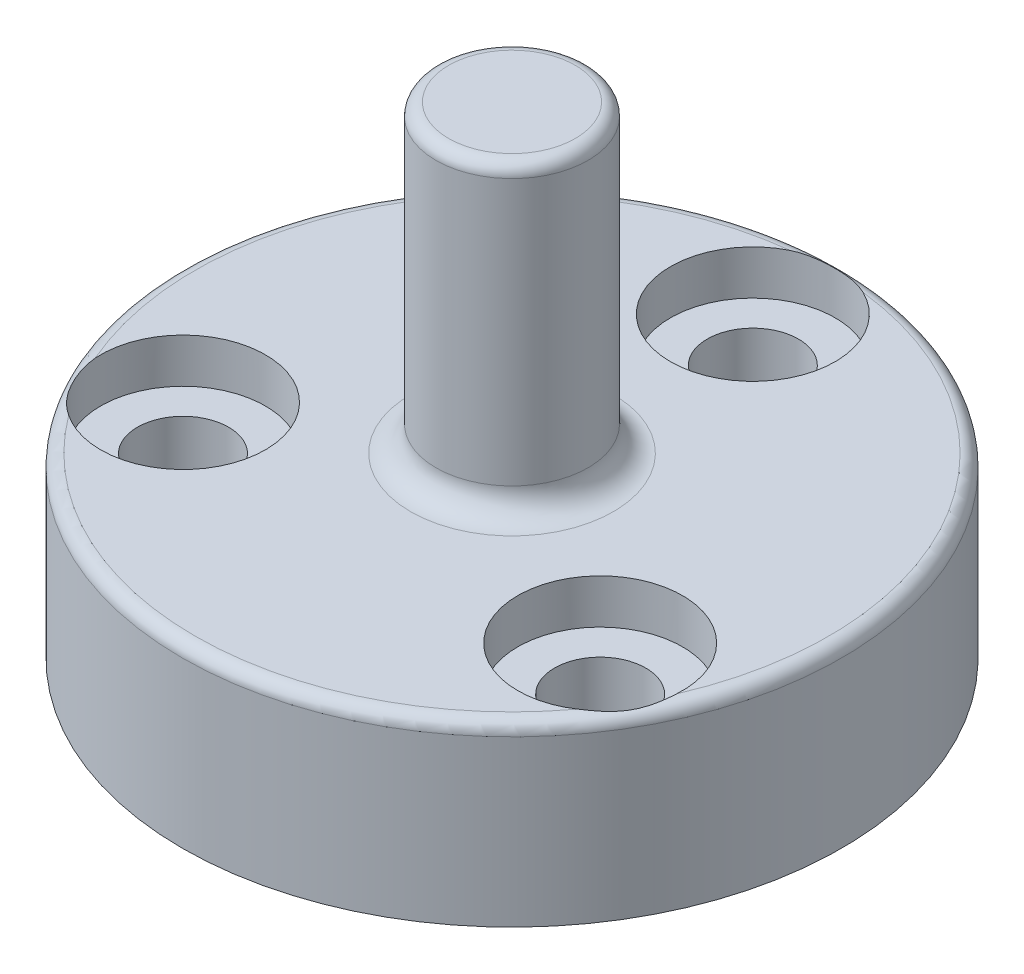
ISO-10303-21;
HEADER;
FILE_DESCRIPTION(('STEP AP214'),'2;1');
FILE_NAME('part.step','',(''),(''),'','','');
FILE_SCHEMA(('AUTOMOTIVE_DESIGN { 1 0 10303 214 1 1 1 1 }'));
ENDSEC;
DATA;
#1=APPLICATION_CONTEXT('core data for automotive mechanical design processes');
#2=APPLICATION_PROTOCOL_DEFINITION('international standard','automotive_design',2000,#1);
#3=PRODUCT_CONTEXT('',#1,'mechanical');
#4=PRODUCT('Part','Part','',(#3));
#5=PRODUCT_RELATED_PRODUCT_CATEGORY('part','',(#4));
#6=PRODUCT_DEFINITION_FORMATION('','',#4);
#7=PRODUCT_DEFINITION_CONTEXT('part definition',#1,'design');
#8=PRODUCT_DEFINITION('design','',#6,#7);
#9=PRODUCT_DEFINITION_SHAPE('','',#8);
#10=(LENGTH_UNIT() NAMED_UNIT(*) SI_UNIT(.MILLI.,.METRE.));
#11=(NAMED_UNIT(*) PLANE_ANGLE_UNIT() SI_UNIT($,.RADIAN.));
#12=(NAMED_UNIT(*) SI_UNIT($,.STERADIAN.) SOLID_ANGLE_UNIT());
#13=UNCERTAINTY_MEASURE_WITH_UNIT(LENGTH_MEASURE(1.E-05),#10,'distance_accuracy_value','');
#14=(GEOMETRIC_REPRESENTATION_CONTEXT(3) GLOBAL_UNCERTAINTY_ASSIGNED_CONTEXT((#13)) GLOBAL_UNIT_ASSIGNED_CONTEXT((#10,
#11,#12)) REPRESENTATION_CONTEXT('',''));
#15=CARTESIAN_POINT('',(0.,0.,0.));
#16=DIRECTION('',(0.,0.,1.));
#17=DIRECTION('',(1.,0.,0.));
#18=AXIS2_PLACEMENT_3D('',#15,#16,#17);
#19=CARTESIAN_POINT('',(0.,7.,0.));
#20=DIRECTION('',(0.,-1.,0.));
#21=DIRECTION('',(0.,0.,-1.));
#22=AXIS2_PLACEMENT_3D('',#19,#20,#21);
#23=CYLINDRICAL_SURFACE('',#22,13.);
#24=CARTESIAN_POINT('',(0.,6.5,0.));
#25=DIRECTION('',(0.,1.,0.));
#26=DIRECTION('',(0.,0.,1.));
#27=AXIS2_PLACEMENT_3D('',#24,#25,#26);
#28=CIRCLE('',#27,13.);
#29=CARTESIAN_POINT('',(0.,6.5,13.));
#30=VERTEX_POINT('',#29);
#31=EDGE_CURVE('E99',#30,#30,#28,.F.);
#32=ORIENTED_EDGE('',*,*,#31,.T.);
#33=EDGE_LOOP('',(#32));
#34=FACE_BOUND('',#33,.T.);
#35=CARTESIAN_POINT('',(0.,0.,0.));
#36=DIRECTION('',(0.,1.,0.));
#37=DIRECTION('',(0.,0.,1.));
#38=AXIS2_PLACEMENT_3D('',#35,#36,#37);
#39=CIRCLE('',#38,13.);
#40=CARTESIAN_POINT('',(0.,0.,13.));
#41=VERTEX_POINT('',#40);
#42=EDGE_CURVE('E95',#41,#41,#39,.T.);
#43=ORIENTED_EDGE('',*,*,#42,.T.);
#44=EDGE_LOOP('',(#43));
#45=FACE_BOUND('',#44,.T.);
#46=ADVANCED_FACE('F35',(#34,#45),#23,.T.);
#47=CARTESIAN_POINT('',(0.,7.,0.));
#48=DIRECTION('',(0.,1.,0.));
#49=DIRECTION('',(0.,0.,1.));
#50=AXIS2_PLACEMENT_3D('',#47,#48,#49);
#51=PLANE('',#50);
#52=CARTESIAN_POINT('',(0.,7.,-9.5));
#53=DIRECTION('',(0.,1.,0.));
#54=DIRECTION('',(0.,0.,1.));
#55=AXIS2_PLACEMENT_3D('',#52,#53,#54);
#56=CIRCLE('',#55,3.25);
#57=CARTESIAN_POINT('',(-1.43148809091607,7.,-12.4177631578943));
#58=VERTEX_POINT('',#57);
#59=CARTESIAN_POINT('',(1.43148809091524,7.,-12.4177631578947));
#60=VERTEX_POINT('',#59);
#61=EDGE_CURVE('E49',#58,#60,#56,.T.);
#62=ORIENTED_EDGE('',*,*,#61,.F.);
#63=CARTESIAN_POINT('',(0.,7.,0.));
#64=DIRECTION('',(0.,1.,0.));
#65=DIRECTION('',(0.,0.,1.));
#66=AXIS2_PLACEMENT_3D('',#63,#64,#65);
#67=CIRCLE('',#66,12.5);
#68=CARTESIAN_POINT('',(-11.4698423983729,7.,4.96917652699988));
#69=VERTEX_POINT('',#68);
#70=EDGE_CURVE('E81',#58,#69,#67,.T.);
#71=ORIENTED_EDGE('',*,*,#70,.T.);
#72=CARTESIAN_POINT('',(-8.22724133595217,7.,4.75));
#73=DIRECTION('',(0.,1.,0.));
#74=DIRECTION('',(0.,0.,1.));
#75=AXIS2_PLACEMENT_3D('',#72,#73,#74);
#76=CIRCLE('',#75,3.25);
#77=CARTESIAN_POINT('',(-10.0383543074569,7.,7.44858663089536));
#78=VERTEX_POINT('',#77);
#79=EDGE_CURVE('E179',#78,#69,#76,.T.);
#80=ORIENTED_EDGE('',*,*,#79,.F.);
#81=CARTESIAN_POINT('',(10.0383543074577,7.,7.44858663089485));
#82=VERTEX_POINT('',#81);
#83=EDGE_CURVE('E93',#78,#82,#67,.T.);
#84=ORIENTED_EDGE('',*,*,#83,.T.);
#85=CARTESIAN_POINT('',(8.22724133595217,7.,4.75));
#86=DIRECTION('',(0.,1.,0.));
#87=DIRECTION('',(0.,0.,1.));
#88=AXIS2_PLACEMENT_3D('',#85,#86,#87);
#89=CIRCLE('',#88,3.25);
#90=CARTESIAN_POINT('',(11.469842398373,7.,4.96917652699896));
#91=VERTEX_POINT('',#90);
#92=EDGE_CURVE('E56',#91,#82,#89,.T.);
#93=ORIENTED_EDGE('',*,*,#92,.F.);
#94=EDGE_CURVE('E83',#91,#60,#67,.T.);
#95=ORIENTED_EDGE('',*,*,#94,.T.);
#96=EDGE_LOOP('',(#62,#71,#80,#84,#93,#95));
#97=FACE_BOUND('',#96,.T.);
#98=CARTESIAN_POINT('',(0.,7.,0.));
#99=DIRECTION('',(0.,1.,0.));
#100=DIRECTION('',(0.,0.,1.));
#101=AXIS2_PLACEMENT_3D('',#98,#99,#100);
#102=CIRCLE('',#101,4.);
#103=CARTESIAN_POINT('',(0.,7.,4.));
#104=VERTEX_POINT('',#103);
#105=EDGE_CURVE('E91',#104,#104,#102,.F.);
#106=ORIENTED_EDGE('',*,*,#105,.T.);
#107=EDGE_LOOP('',(#106));
#108=FACE_BOUND('',#107,.T.);
#109=ADVANCED_FACE('F78',(#97,#108),#51,.T.);
#110=CARTESIAN_POINT('',(0.,0.,0.));
#111=DIRECTION('',(0.,1.,0.));
#112=DIRECTION('',(0.,0.,1.));
#113=AXIS2_PLACEMENT_3D('',#110,#111,#112);
#114=PLANE('',#113);
#115=CARTESIAN_POINT('',(0.,0.,0.));
#116=DIRECTION('',(0.,1.,0.));
#117=DIRECTION('',(0.,0.,1.));
#118=AXIS2_PLACEMENT_3D('',#115,#116,#117);
#119=CIRCLE('',#118,7.665);
#120=CARTESIAN_POINT('',(0.,0.,7.665));
#121=VERTEX_POINT('',#120);
#122=EDGE_CURVE('E220',#121,#121,#119,.T.);
#123=ORIENTED_EDGE('',*,*,#122,.T.);
#124=EDGE_LOOP('',(#123));
#125=FACE_BOUND('',#124,.T.);
#126=CARTESIAN_POINT('',(0.,0.,-9.5));
#127=DIRECTION('',(0.,1.,0.));
#128=DIRECTION('',(0.,0.,1.));
#129=AXIS2_PLACEMENT_3D('',#126,#127,#128);
#130=CIRCLE('',#129,1.8);
#131=CARTESIAN_POINT('',(0.,0.,-7.7));
#132=VERTEX_POINT('',#131);
#133=EDGE_CURVE('E191',#132,#132,#130,.T.);
#134=ORIENTED_EDGE('',*,*,#133,.T.);
#135=EDGE_LOOP('',(#134));
#136=FACE_BOUND('',#135,.T.);
#137=CARTESIAN_POINT('',(8.22724133595217,0.,4.75));
#138=DIRECTION('',(0.,1.,0.));
#139=DIRECTION('',(0.,0.,1.));
#140=AXIS2_PLACEMENT_3D('',#137,#138,#139);
#141=CIRCLE('',#140,1.8);
#142=CARTESIAN_POINT('',(8.22724133595217,0.,6.55));
#143=VERTEX_POINT('',#142);
#144=EDGE_CURVE('E181',#143,#143,#141,.T.);
#145=ORIENTED_EDGE('',*,*,#144,.T.);
#146=EDGE_LOOP('',(#145));
#147=FACE_BOUND('',#146,.T.);
#148=CARTESIAN_POINT('',(-8.22724133595217,0.,4.75));
#149=DIRECTION('',(0.,1.,0.));
#150=DIRECTION('',(0.,0.,1.));
#151=AXIS2_PLACEMENT_3D('',#148,#149,#150);
#152=CIRCLE('',#151,1.8);
#153=CARTESIAN_POINT('',(-8.22724133595217,0.,6.55));
#154=VERTEX_POINT('',#153);
#155=EDGE_CURVE('E168',#154,#154,#152,.T.);
#156=ORIENTED_EDGE('',*,*,#155,.T.);
#157=EDGE_LOOP('',(#156));
#158=FACE_BOUND('',#157,.T.);
#159=ORIENTED_EDGE('',*,*,#42,.F.);
#160=EDGE_LOOP('',(#159));
#161=FACE_BOUND('',#160,.T.);
#162=ADVANCED_FACE('F152',(#125,#136,#147,#158,#161),#114,.F.);
#163=CARTESIAN_POINT('',(0.,5.15,0.));
#164=DIRECTION('',(0.,-1.,0.));
#165=DIRECTION('',(0.,0.,-1.));
#166=AXIS2_PLACEMENT_3D('',#163,#164,#165);
#167=CYLINDRICAL_SURFACE('',#166,7.165);
#168=CARTESIAN_POINT('',(0.,0.5,0.));
#169=DIRECTION('',(0.,1.,0.));
#170=DIRECTION('',(0.,0.,1.));
#171=AXIS2_PLACEMENT_3D('',#168,#169,#170);
#172=CIRCLE('',#171,7.165);
#173=CARTESIAN_POINT('',(0.,0.5,7.165));
#174=VERTEX_POINT('',#173);
#175=EDGE_CURVE('E74',#174,#174,#172,.F.);
#176=ORIENTED_EDGE('',*,*,#175,.T.);
#177=EDGE_LOOP('',(#176));
#178=FACE_BOUND('',#177,.T.);
#179=CARTESIAN_POINT('',(0.,5.15,0.));
#180=DIRECTION('',(0.,-1.,0.));
#181=DIRECTION('',(0.,0.,-1.));
#182=AXIS2_PLACEMENT_3D('',#179,#180,#181);
#183=CIRCLE('',#182,7.165);
#184=CARTESIAN_POINT('',(0.,5.15,-7.165));
#185=VERTEX_POINT('',#184);
#186=EDGE_CURVE('E165',#185,#185,#183,.T.);
#187=ORIENTED_EDGE('',*,*,#186,.F.);
#188=EDGE_LOOP('',(#187));
#189=FACE_BOUND('',#188,.T.);
#190=ADVANCED_FACE('F148',(#178,#189),#167,.F.);
#191=CARTESIAN_POINT('',(0.,5.15,0.));
#192=DIRECTION('',(0.,-1.,0.));
#193=DIRECTION('',(0.,0.,-1.));
#194=AXIS2_PLACEMENT_3D('',#191,#192,#193);
#195=PLANE('',#194);
#196=ORIENTED_EDGE('',*,*,#186,.T.);
#197=EDGE_LOOP('',(#196));
#198=FACE_BOUND('',#197,.T.);
#199=ADVANCED_FACE('F144',(#198),#195,.T.);
#200=CARTESIAN_POINT('',(0.,19.,0.));
#201=DIRECTION('',(0.,-1.,0.));
#202=DIRECTION('',(0.,0.,-1.));
#203=AXIS2_PLACEMENT_3D('',#200,#201,#202);
#204=CYLINDRICAL_SURFACE('',#203,3.);
#205=CARTESIAN_POINT('',(0.,18.5,0.));
#206=DIRECTION('',(0.,1.,0.));
#207=DIRECTION('',(0.,0.,1.));
#208=AXIS2_PLACEMENT_3D('',#205,#206,#207);
#209=CIRCLE('',#208,3.);
#210=CARTESIAN_POINT('',(0.,18.5,3.));
#211=VERTEX_POINT('',#210);
#212=EDGE_CURVE('E12',#211,#211,#209,.F.);
#213=ORIENTED_EDGE('',*,*,#212,.T.);
#214=EDGE_LOOP('',(#213));
#215=FACE_BOUND('',#214,.T.);
#216=CARTESIAN_POINT('',(0.,8.,0.));
#217=DIRECTION('',(0.,1.,0.));
#218=DIRECTION('',(0.,0.,1.));
#219=AXIS2_PLACEMENT_3D('',#216,#217,#218);
#220=CIRCLE('',#219,3.);
#221=CARTESIAN_POINT('',(0.,8.,3.));
#222=VERTEX_POINT('',#221);
#223=EDGE_CURVE('E101',#222,#222,#220,.T.);
#224=ORIENTED_EDGE('',*,*,#223,.T.);
#225=EDGE_LOOP('',(#224));
#226=FACE_BOUND('',#225,.T.);
#227=ADVANCED_FACE('F140',(#215,#226),#204,.T.);
#228=CARTESIAN_POINT('',(0.,19.,0.));
#229=DIRECTION('',(0.,1.,0.));
#230=DIRECTION('',(0.,0.,1.));
#231=AXIS2_PLACEMENT_3D('',#228,#229,#230);
#232=PLANE('',#231);
#233=CARTESIAN_POINT('',(0.,19.,0.));
#234=DIRECTION('',(0.,1.,0.));
#235=DIRECTION('',(0.,0.,1.));
#236=AXIS2_PLACEMENT_3D('',#233,#234,#235);
#237=CIRCLE('',#236,2.5);
#238=CARTESIAN_POINT('',(0.,19.,2.5));
#239=VERTEX_POINT('',#238);
#240=EDGE_CURVE('E43',#239,#239,#237,.T.);
#241=ORIENTED_EDGE('',*,*,#240,.T.);
#242=EDGE_LOOP('',(#241));
#243=FACE_BOUND('',#242,.T.);
#244=ADVANCED_FACE('F137',(#243),#232,.T.);
#245=CARTESIAN_POINT('',(0.,6.5,0.));
#246=DIRECTION('',(0.,1.,0.));
#247=DIRECTION('',(0.,0.,1.));
#248=AXIS2_PLACEMENT_3D('',#245,#246,#247);
#249=TOROIDAL_SURFACE('',#248,12.5,0.5);
#250=CARTESIAN_POINT('',(2.32289714323154,6.4998,-11.7730263663158));
#251=CARTESIAN_POINT('',(2.32294582360261,6.5193849700488,-11.772968056724));
#252=CARTESIAN_POINT('',(2.32149768032194,6.53889474378671,-11.7744569972748));
#253=CARTESIAN_POINT('',(2.31596514873864,6.57690476094697,-11.7800943829729));
#254=CARTESIAN_POINT('',(2.31191313733976,6.59541441663927,-11.7842101613848));
#255=CARTESIAN_POINT('',(2.30153819536947,6.63099496841405,-11.7946616250335));
#256=CARTESIAN_POINT('',(2.29522529014567,6.64807181171287,-11.8009875071549));
#257=CARTESIAN_POINT('',(2.28072983856405,6.68067873706798,-11.8153567924029));
#258=CARTESIAN_POINT('',(2.27254135813619,6.69620368025894,-11.8234056413623));
#259=CARTESIAN_POINT('',(2.25011879447368,6.73309911740447,-11.8451682710275));
#260=CARTESIAN_POINT('',(2.2349306951996,6.75341532798045,-11.8596783038908));
#261=CARTESIAN_POINT('',(2.20214893356452,6.79056853843765,-11.8903032118163));
#262=CARTESIAN_POINT('',(2.18455027626657,6.80739812680338,-11.9064213998048));
#263=CARTESIAN_POINT('',(2.13507480115096,6.84843820550901,-11.9506464541409));
#264=CARTESIAN_POINT('',(2.10160295551826,6.86992351277271,-11.9794767530445));
#265=CARTESIAN_POINT('',(2.03147940328419,6.90648899133179,-12.0372582733377));
#266=CARTESIAN_POINT('',(1.99482026555253,6.92155368322558,-12.0662096189232));
#267=CARTESIAN_POINT('',(1.92147670777863,6.94604677741904,-12.1215284016178));
#268=CARTESIAN_POINT('',(1.88492219290844,6.95575599117287,-12.1479473553244));
#269=CARTESIAN_POINT('',(1.81022448763287,6.97180040131686,-12.1995652454309));
#270=CARTESIAN_POINT('',(1.77207995829279,6.97813268951677,-12.2247631133173));
#271=CARTESIAN_POINT('',(1.6944521704152,6.98814826867738,-12.2737053118712));
#272=CARTESIAN_POINT('',(1.65496673486534,6.99182701283104,-12.2974470841705));
#273=CARTESIAN_POINT('',(1.57491060395161,6.99708805689706,-12.3432880077953));
#274=CARTESIAN_POINT('',(1.5343395232417,6.9986696020699,-12.3653865650618));
#275=CARTESIAN_POINT('',(1.41939474916131,7.00082255221109,-12.4248481692397));
#276=CARTESIAN_POINT('',(1.34397154726974,6.99957057541926,-12.4602622381989));
#277=CARTESIAN_POINT('',(1.19071082682785,6.99394807607661,-12.5251688472376));
#278=CARTESIAN_POINT('',(1.11287156116289,6.98957524402131,-12.5546569812657));
#279=CARTESIAN_POINT('',(0.955221575094676,6.97942276521122,-12.6075658952238));
#280=CARTESIAN_POINT('',(0.875410192971379,6.97364264033493,-12.6309846075003));
#281=CARTESIAN_POINT('',(0.714223945660765,6.96216592231835,-12.6716389180903));
#282=CARTESIAN_POINT('',(0.632849081456193,6.95646932912554,-12.6888745202902));
#283=CARTESIAN_POINT('',(0.464633258701678,6.94618230896119,-12.7178056846878));
#284=CARTESIAN_POINT('',(0.377729168669717,6.94166540640072,-12.7291639698069));
#285=CARTESIAN_POINT('',(0.203186919082394,6.93526791746852,-12.7448252562511));
#286=CARTESIAN_POINT('',(0.11554878913054,6.93338722528968,-12.7491285407374));
#287=CARTESIAN_POINT('',(-0.0597947452362229,6.9327410200106,-12.7506323384549));
#288=CARTESIAN_POINT('',(-0.14750014426421,6.93397527916754,-12.7478333709516));
#289=CARTESIAN_POINT('',(-0.322309984517582,6.93924283877663,-12.7351658148437));
#290=CARTESIAN_POINT('',(-0.409414402868287,6.94327624518353,-12.7252969586255));
#291=CARTESIAN_POINT('',(-0.580694084049366,6.95303743330767,-12.6988518732584));
#292=CARTESIAN_POINT('',(-0.664893030081406,6.95872952281264,-12.6824144713559));
#293=CARTESIAN_POINT('',(-0.831704965173401,6.97048400001713,-12.6429467389411));
#294=CARTESIAN_POINT('',(-0.914317902606301,6.97654639974405,-12.6199161941988));
#295=CARTESIAN_POINT('',(-1.0775286306094,6.9874471972638,-12.5673729852366));
#296=CARTESIAN_POINT('',(-1.15812691105925,6.99228589527041,-12.5378619142261));
#297=CARTESIAN_POINT('',(-1.31679063181787,6.99889112863385,-12.4725276866974));
#298=CARTESIAN_POINT('',(-1.39485804198479,7.00066011246589,-12.4367095859553));
#299=CARTESIAN_POINT('',(-1.55015406447215,6.99885501975644,-12.3578489422672));
#300=CARTESIAN_POINT('',(-1.62729338411791,6.99512520528724,-12.3146276743639));
#301=CARTESIAN_POINT('',(-1.73954007950499,6.98273054392481,-12.2456203414352));
#302=CARTESIAN_POINT('',(-1.77633596595315,6.97747616624074,-12.2219532845858));
#303=CARTESIAN_POINT('',(-1.8485778472228,6.96410413184481,-12.1734150859297));
#304=CARTESIAN_POINT('',(-1.88402472201542,6.9559883783718,-12.1485447539432));
#305=CARTESIAN_POINT('',(-1.9521037285948,6.93647272017266,-12.0987517401757));
#306=CARTESIAN_POINT('',(-1.98479023441174,6.92519075770492,-12.0738581929638));
#307=CARTESIAN_POINT('',(-2.04816265061007,6.89833589894292,-12.023718782734));
#308=CARTESIAN_POINT('',(-2.07884782351756,6.88276143182208,-11.9984727939584));
#309=CARTESIAN_POINT('',(-2.13196083890808,6.84954087485805,-11.9532076902862));
#310=CARTESIAN_POINT('',(-2.15486605069407,6.83281116441732,-11.933085696562));
#311=CARTESIAN_POINT('',(-2.19802726176041,6.79494476721211,-11.8941619517224));
#312=CARTESIAN_POINT('',(-2.21829004768118,6.77381974677945,-11.8753568782875));
#313=CARTESIAN_POINT('',(-2.24783434053418,6.73563299925526,-11.8473355265794));
#314=CARTESIAN_POINT('',(-2.25832809793701,6.72016987134265,-11.8372277235373));
#315=CARTESIAN_POINT('',(-2.27744318694681,6.68723531921139,-11.8186050542369));
#316=CARTESIAN_POINT('',(-2.28606650583445,6.66976605693838,-11.8100884986765));
#317=CARTESIAN_POINT('',(-2.2996643628688,6.63607659503669,-11.7965453292829));
#318=CARTESIAN_POINT('',(-2.30500975424101,6.62014744766245,-11.7911717409692));
#319=CARTESIAN_POINT('',(-2.31373472987854,6.58725851175544,-11.782360746326));
#320=CARTESIAN_POINT('',(-2.31711863941386,6.57030108267592,-11.7789190804422));
#321=CARTESIAN_POINT('',(-2.32056310731193,6.5442889245831,-11.7754097301976));
#322=CARTESIAN_POINT('',(-2.32143963481289,6.53544275131314,-11.7745151416193));
#323=CARTESIAN_POINT('',(-2.32260964095421,6.51766616565647,-11.7733202044124));
#324=CARTESIAN_POINT('',(-2.32290271941726,6.50873569967021,-11.7730202636427));
#325=CARTESIAN_POINT('',(-2.32289714323154,6.4998,-11.7730263663158));
#326=B_SPLINE_CURVE_WITH_KNOTS('',3,(#250,#251,#252,#253,#254,#255,#256,#257,#258,#259,#260,
#261,#262,#263,#264,#265,#266,#267,#268,#269,#270,#271,#272,#273,#274,#275,#276,#277,#278,#279,
#280,#281,#282,#283,#284,#285,#286,#287,#288,#289,#290,#291,#292,#293,#294,#295,#296,#297,#298,
#299,#300,#301,#302,#303,#304,#305,#306,#307,#308,#309,#310,#311,#312,#313,#314,#315,#316,#317,
#318,#319,#320,#321,#322,#323,#324,#325),.UNSPECIFIED.,.F.,.F.,(4,2,2,2,2,2,2,2,2,2,2,2,2,2,2,2,
2,2,2,2,2,2,2,2,2,2,2,2,2,2,2,2,2,2,2,2,2,4),(0.,0.0585221952373698,0.11633043781214,
0.173885455565322,0.231625148488896,0.318797493972694,0.406153282352327,0.552697476252233,
0.699593000634574,0.83779461920717,0.976115064856868,1.11467196106424,1.25327870757728,
1.50289140615813,1.75268901565189,2.00257161149424,2.25245405027532,2.51541856378839,
2.77837252263775,3.04130725674265,3.30425194412995,3.56191063146293,3.81957769181594,
4.07718147661067,4.33457969604716,4.59940944488962,4.73150358665779,4.86351003149478,
4.99113514243283,5.11880701947318,5.22285808269157,5.32663641141081,5.39019160489488,
5.45367893863156,5.50639332925263,5.55899103260248,5.58575925142011,5.61254582376588),.UNSPECIFIED.);
#327=EDGE_CURVE('E67',#60,#58,#326,.T.);
#328=ORIENTED_EDGE('',*,*,#327,.F.);
#329=ORIENTED_EDGE('',*,*,#94,.F.);
#330=CARTESIAN_POINT('',(9.0342913410377,6.4998,7.89820111957471));
#331=CARTESIAN_POINT('',(9.03421650326442,6.5193849700488,7.89821412321683));
#332=CARTESIAN_POINT('',(9.03623003524647,6.53889474378671,7.89770446462285));
#333=CARTESIAN_POINT('',(9.04387842026357,6.57690476094697,7.8957318445735));
#334=CARTESIAN_POINT('',(9.0494687946241,6.59541441663927,7.89428058897163));
#335=CARTESIAN_POINT('',(9.06370749863571,6.63099496841405,7.89052135748689));
#336=CARTESIAN_POINT('',(9.07234232586611,6.64807181171287,7.88821716225211));
#337=CARTESIAN_POINT('',(9.09203421771588,6.68067873706798,7.88284837556708));
#338=CARTESIAN_POINT('',(9.10309896559987,6.69620368025895,7.87978136797786));
#339=CARTESIAN_POINT('',(9.13315723757434,6.73309911740447,7.87124417306075));
#340=CARTESIAN_POINT('',(9.15331734428081,6.75341532798046,7.86534590968589));
#341=CARTESIAN_POINT('',(9.19623017335034,6.79056853843765,7.85226852529182));
#342=CARTESIAN_POINT('',(9.21898826226031,6.80739812680338,7.84508673499354));
#343=CARTESIAN_POINT('',(9.28202602035694,6.84843820550901,7.82435224384717));
#344=CARTESIAN_POINT('',(9.32372971442254,6.86992351277271,7.80977992466952));
#345=CARTESIAN_POINT('',(9.40883175498276,6.90648899133179,7.7779419071778));
#346=CARTESIAN_POINT('',(9.45223392459941,6.92155368322558,7.76066983541413));
#347=CARTESIAN_POINT('',(9.53681317460627,6.94604677741904,7.72481184252527));
#348=CARTESIAN_POINT('',(9.57796991709274,6.95575599117287,7.706364180878));
#349=CARTESIAN_POINT('',(9.66002117385247,6.97180040131686,7.66748301555818));
#350=CARTESIAN_POINT('',(9.70091543223335,6.97813268951678,7.64704781807748));
#351=CARTESIAN_POINT('',(9.78211451343683,6.98814826867738,7.60429128101281));
#352=CARTESIAN_POINT('',(9.82241820915383,6.99182701283105,7.5819667768968));
#353=CARTESIAN_POINT('',(9.90214567900276,6.99708805689707,7.53555659560924));
#354=CARTESIAN_POINT('',(9.94156913133752,6.9986696020699,7.51147028768873));
#355=CARTESIAN_POINT('',(10.0505367781455,7.00082255221109,7.44165599539178));
#356=CARTESIAN_POINT('',(10.1189178624614,6.99957057541926,7.39404462099854));
#357=CARTESIAN_POINT('',(10.2517589949833,6.99394807607661,7.29377024821287));
#358=CARTESIAN_POINT('',(10.3162161009943,6.98957524402131,7.24110353374916));
#359=CARTESIAN_POINT('',(10.4408615576028,6.97942276521122,7.13102909788687));
#360=CARTESIAN_POINT('',(10.5010484484198,6.97364264033493,7.07361976959519));
#361=CARTESIAN_POINT('',(10.6168492378194,6.96216592231835,6.95435553997852));
#362=CARTESIAN_POINT('',(10.6724631392763,6.95646932912554,6.89250064144778));
#363=CARTESIAN_POINT('',(10.7816261739829,6.94618230896119,6.76128704782268));
#364=CARTESIAN_POINT('',(10.8349147824555,6.94166540640072,6.69170504072178));
#365=CARTESIAN_POINT('',(10.9357489791658,6.93526791746852,6.54837766176759));
#366=CARTESIAN_POINT('',(10.9832947978266,6.93338722528968,6.47463245713226));
#367=CARTESIAN_POINT('',(11.0722688920355,6.9327410200106,6.32353240084006));
#368=CARTESIAN_POINT('',(11.1136976145872,6.93397527916754,6.24617781348112));
#369=CARTESIAN_POINT('',(11.1901321093206,6.93924283877663,6.08845427293621));
#370=CARTESIAN_POINT('',(11.2251376383047,6.94327624518353,6.00808520575355));
#371=CARTESIAN_POINT('',(11.287875363162,6.95303743330767,5.84653010801508));
#372=CARTESIAN_POINT('',(11.3157396285583,6.95872952281264,5.7653929808282));
#373=CARTESIAN_POINT('',(11.3649655372034,6.97048400001713,5.60119574117673));
#374=CARTESIAN_POINT('',(11.38632696911,6.97654639974405,5.51813556630743));
#375=CARTESIAN_POINT('',(11.4224285793539,6.9874471972638,5.35051932520549));
#376=CARTESIAN_POINT('',(11.4371703823908,6.99228589527041,5.26596363132934));
#377=CARTESIAN_POINT('',(11.4599211419936,6.99889112863386,5.09588970472902));
#378=CARTESIAN_POINT('',(11.4679354619191,7.00066011246589,5.01037229394577));
#379=CARTESIAN_POINT('',(11.4772881523701,6.99885501975644,4.836451671521));
#380=CARTESIAN_POINT('',(11.478427096205,6.99512520528724,4.74803642712547));
#381=CARTESIAN_POINT('',(11.4747883405349,6.98273054392481,4.61632427096508));
#382=CARTESIAN_POINT('',(11.4726900112945,6.97747616624074,4.57262457012149));
#383=CARTESIAN_POINT('',(11.4667756388393,6.96410413184481,4.48579216639676));
#384=CARTESIAN_POINT('',(11.4629607369347,6.9559883783718,4.4426591063483));
#385=CARTESIAN_POINT('',(11.4538782253707,6.93647272017266,4.35880445030241));
#386=CARTESIAN_POINT('',(11.4486630340034,6.92519075770492,4.31805033229805));
#387=CARTESIAN_POINT('',(11.4369272391128,6.89833589894291,4.23809850485621));
#388=CARTESIAN_POINT('',(11.4304061579432,6.88276143182208,4.19890137121098));
#389=CARTESIAN_POINT('',(11.4177619359534,6.84954087485804,4.13027159877514));
#390=CARTESIAN_POINT('',(11.4117883841064,6.83281116441731,4.10037410662727));
#391=CARTESIAN_POINT('',(11.3996600377981,6.79494476721211,4.04353352896591));
#392=CARTESIAN_POINT('',(11.3935057594438,6.77381974677945,4.01658290488966));
#393=CARTESIAN_POINT('',(11.3840107034427,6.73563299925526,3.97698612088805));
#394=CARTESIAN_POINT('',(11.3805039679332,6.72016987134264,3.962844358875));
#395=CARTESIAN_POINT('',(11.3739338077377,6.68723531921138,3.93697887154669));
#396=CARTESIAN_POINT('',(11.3708699137135,6.66976605693838,3.92525258054487));
#397=CARTESIAN_POINT('',(11.3659401134881,6.63607659503668,3.90670490621934));
#398=CARTESIAN_POINT('',(11.363959145185,6.62014744766244,3.89938886734095));
#399=CARTESIAN_POINT('',(11.3606910878102,6.58725851175543,3.88742731946987));
#400=CARTESIAN_POINT('',(11.3594024724911,6.57030108267592,3.88277593490624));
#401=CARTESIAN_POINT('',(11.3580855199775,6.5442889245831,3.87803826308168));
#402=CARTESIAN_POINT('',(11.3577490472933,6.53544275131314,3.87683187370964));
#403=CARTESIAN_POINT('',(11.3572992043869,6.51766616565647,3.87522115006522));
#404=CARTESIAN_POINT('',(11.3571859872922,6.50873569967021,3.87481736628603));
#405=CARTESIAN_POINT('',(11.3571884842692,6.4998,3.87482524674108));
#406=B_SPLINE_CURVE_WITH_KNOTS('',3,(#330,#331,#332,#333,#334,#335,#336,#337,#338,#339,#340,
#341,#342,#343,#344,#345,#346,#347,#348,#349,#350,#351,#352,#353,#354,#355,#356,#357,#358,#359,
#360,#361,#362,#363,#364,#365,#366,#367,#368,#369,#370,#371,#372,#373,#374,#375,#376,#377,#378,
#379,#380,#381,#382,#383,#384,#385,#386,#387,#388,#389,#390,#391,#392,#393,#394,#395,#396,#397,
#398,#399,#400,#401,#402,#403,#404,#405),.UNSPECIFIED.,.F.,.F.,(4,2,2,2,2,2,2,2,2,2,2,2,2,2,2,2,
2,2,2,2,2,2,2,2,2,2,2,2,2,2,2,2,2,2,2,2,2,4),(0.,0.0585221952373702,0.11633043781214,
0.173885455565323,0.231625148488897,0.318797493972694,0.406153282352327,0.552697476252234,
0.699593000634577,0.837794619207174,0.976115064856872,1.11467196106425,1.25327870757729,
1.50289140615813,1.75268901565189,2.00257161149425,2.25245405027533,2.5154185637884,
2.77837252263777,3.04130725674267,3.30425194412996,3.56191063146294,3.81957769181595,
4.07718147661069,4.33457969604718,4.59940944488963,4.7315035866578,4.86351003149479,
4.99113514243284,5.11880701947318,5.22285808269158,5.32663641141081,5.39019160489488,
5.45367893863156,5.50639332925263,5.55899103260248,5.58575925142011,5.61254582376587),.UNSPECIFIED.);
#407=EDGE_CURVE('E75',#82,#91,#406,.T.);
#408=ORIENTED_EDGE('',*,*,#407,.F.);
#409=ORIENTED_EDGE('',*,*,#83,.F.);
#410=CARTESIAN_POINT('',(-11.3571884842692,6.4998,3.87482524674108));
#411=CARTESIAN_POINT('',(-11.357162326867,6.5193849700488,3.87475393350719));
#412=CARTESIAN_POINT('',(-11.3577277155684,6.53889474378671,3.87675253265196));
#413=CARTESIAN_POINT('',(-11.3598435690022,6.57690476094697,3.88436253839937));
#414=CARTESIAN_POINT('',(-11.3613819319639,6.59541441663927,3.88992957241319));
#415=CARTESIAN_POINT('',(-11.3652456940052,6.63099496841405,3.90414026754659));
#416=CARTESIAN_POINT('',(-11.3675676160118,6.64807181171287,3.91277034490279));
#417=CARTESIAN_POINT('',(-11.3727640562799,6.68067873706798,3.93250841683578));
#418=CARTESIAN_POINT('',(-11.3756403237361,6.69620368025895,3.9436242733844));
#419=CARTESIAN_POINT('',(-11.383276032048,6.73309911740447,3.9739240979667));
#420=CARTESIAN_POINT('',(-11.3882480394804,6.75341532798045,3.99433239420495));
#421=CARTESIAN_POINT('',(-11.3983791069149,6.79056853843765,4.03803468652445));
#422=CARTESIAN_POINT('',(-11.4035385385269,6.80739812680338,4.06133466481121));
#423=CARTESIAN_POINT('',(-11.4171008215079,6.84843820550901,4.12629421029369));
#424=CARTESIAN_POINT('',(-11.4253326699408,6.86992351277271,4.16969682837498));
#425=CARTESIAN_POINT('',(-11.4403111582669,6.90648899133179,4.25931636615988));
#426=CARTESIAN_POINT('',(-11.4470541901519,6.92155368322558,4.3055397835091));
#427=CARTESIAN_POINT('',(-11.4582898823849,6.94604677741904,4.3967165590925));
#428=CARTESIAN_POINT('',(-11.4628921100012,6.95575599117287,4.44158317444643));
#429=CARTESIAN_POINT('',(-11.4702456614853,6.97180040131686,4.5320822298727));
#430=CARTESIAN_POINT('',(-11.4729953905261,6.97813268951677,4.57771529523982));
#431=CARTESIAN_POINT('',(-11.476566683852,6.98814826867738,4.66941403085832));
#432=CARTESIAN_POINT('',(-11.4773849440192,6.99182701283104,4.71548030727365));
#433=CARTESIAN_POINT('',(-11.4770562829544,6.99708805689706,4.80773141218605));
#434=CARTESIAN_POINT('',(-11.4759086545792,6.99866960206989,4.8539162773731));
#435=CARTESIAN_POINT('',(-11.4699315273068,7.00082255221109,4.9831921738479));
#436=CARTESIAN_POINT('',(-11.4628894097311,6.99957057541926,5.06621761720038));
#437=CARTESIAN_POINT('',(-11.4424698218111,6.99394807607661,5.23139859902468));
#438=CARTESIAN_POINT('',(-11.4290876621572,6.98957524402131,5.31355344751654));
#439=CARTESIAN_POINT('',(-11.3960831326975,6.97942276521122,5.47653679733692));
#440=CARTESIAN_POINT('',(-11.3764586413912,6.97364264033493,5.55736483790507));
#441=CARTESIAN_POINT('',(-11.3310731834802,6.96216592231835,5.71728337811175));
#442=CARTESIAN_POINT('',(-11.3053122207325,6.95646932912555,5.79637387884236));
#443=CARTESIAN_POINT('',(-11.2462594326846,6.94618230896119,5.95651863686508));
#444=CARTESIAN_POINT('',(-11.2126439511252,6.94166540640072,6.03745892908507));
#445=CARTESIAN_POINT('',(-11.1389358982482,6.93526791746852,6.19644759448349));
#446=CARTESIAN_POINT('',(-11.0988435869571,6.93338722528968,6.2744960836051));
#447=CARTESIAN_POINT('',(-11.0124741467992,6.9327410200106,6.42709993761483));
#448=CARTESIAN_POINT('',(-10.966197470323,6.93397527916754,6.50165555747047));
#449=CARTESIAN_POINT('',(-10.867822124803,6.93924283877663,6.6467115419074));
#450=CARTESIAN_POINT('',(-10.8157232354364,6.94327624518353,6.71721175287189));
#451=CARTESIAN_POINT('',(-10.7071812791127,6.95303743330767,6.85232176524326));
#452=CARTESIAN_POINT('',(-10.6508465984769,6.95872952281264,6.91702149052762));
#453=CARTESIAN_POINT('',(-10.53326057203,6.97048400001713,7.04175099776437));
#454=CARTESIAN_POINT('',(-10.4720090665037,6.97654639974405,7.10178062789136));
#455=CARTESIAN_POINT('',(-10.3448999487445,6.9874471972638,7.21685366003108));
#456=CARTESIAN_POINT('',(-10.2790434713316,6.99228589527041,7.27189828289676));
#457=CARTESIAN_POINT('',(-10.1431305101757,6.99889112863385,7.3766379819683));
#458=CARTESIAN_POINT('',(-10.0730774199343,7.00066011246589,7.42633729200947));
#459=CARTESIAN_POINT('',(-9.92713408789799,6.99885501975644,7.52139727074617));
#460=CARTESIAN_POINT('',(-9.85113371208707,6.99512520528724,7.56659124723839));
#461=CARTESIAN_POINT('',(-9.73524826102989,6.98273054392482,7.62929607047013));
#462=CARTESIAN_POINT('',(-9.69635404534141,6.97747616624074,7.6493287144643));
#463=CARTESIAN_POINT('',(-9.61819779161647,6.96410413184481,7.68762291953294));
#464=CARTESIAN_POINT('',(-9.57893601491925,6.95598837837181,7.70588564759484));
#465=CARTESIAN_POINT('',(-9.50177449677594,6.93647272017267,7.73994728987326));
#466=CARTESIAN_POINT('',(-9.46387279959167,6.92519075770492,7.75580786066574));
#467=CARTESIAN_POINT('',(-9.38876458850274,6.89833589894292,7.7856202778778));
#468=CARTESIAN_POINT('',(-9.35155833442564,6.88276143182208,7.79957142274738));
#469=CARTESIAN_POINT('',(-9.28580109704537,6.84954087485805,7.8229360915111));
#470=CARTESIAN_POINT('',(-9.25692233341235,6.83281116441732,7.83271158993468));
#471=CARTESIAN_POINT('',(-9.20163277603767,6.79494476721211,7.85062842275645));
#472=CARTESIAN_POINT('',(-9.17521571176267,6.77381974677945,7.85877397339785));
#473=CARTESIAN_POINT('',(-9.13617636290856,6.73563299925526,7.87034940569134));
#474=CARTESIAN_POINT('',(-9.12217586999624,6.72016987134265,7.87438336466229));
#475=CARTESIAN_POINT('',(-9.09649062079088,6.68723531921138,7.88162618269015));
#476=CARTESIAN_POINT('',(-9.08480340787902,6.66976605693838,7.88483591813159));
#477=CARTESIAN_POINT('',(-9.0662757506193,6.63607659503669,7.88984042306361));
#478=CARTESIAN_POINT('',(-9.058949390944,6.62014744766245,7.89178287362823));
#479=CARTESIAN_POINT('',(-9.04695635793164,6.58725851175544,7.89493342685614));
#480=CARTESIAN_POINT('',(-9.04228383307724,6.57030108267593,7.89614314553593));
#481=CARTESIAN_POINT('',(-9.03752241266558,6.5442889245831,7.89737146711586));
#482=CARTESIAN_POINT('',(-9.03630941248043,6.53544275131314,7.8976832679097));
#483=CARTESIAN_POINT('',(-9.03468956343267,6.51766616565647,7.89809905434721));
#484=CARTESIAN_POINT('',(-9.0342832678749,6.50873569967021,7.89820289735663));
#485=CARTESIAN_POINT('',(-9.03429134103771,6.4998,7.8982011195747));
#486=B_SPLINE_CURVE_WITH_KNOTS('',3,(#410,#411,#412,#413,#414,#415,#416,#417,#418,#419,#420,
#421,#422,#423,#424,#425,#426,#427,#428,#429,#430,#431,#432,#433,#434,#435,#436,#437,#438,#439,
#440,#441,#442,#443,#444,#445,#446,#447,#448,#449,#450,#451,#452,#453,#454,#455,#456,#457,#458,
#459,#460,#461,#462,#463,#464,#465,#466,#467,#468,#469,#470,#471,#472,#473,#474,#475,#476,#477,
#478,#479,#480,#481,#482,#483,#484,#485),.UNSPECIFIED.,.F.,.F.,(4,2,2,2,2,2,2,2,2,2,2,2,2,2,2,2,
2,2,2,2,2,2,2,2,2,2,2,2,2,2,2,2,2,2,2,2,2,4),(0.,0.0585221952373719,0.116330437812142,
0.173885455565323,0.231625148488897,0.318797493972692,0.406153282352326,0.55269747625223,
0.699593000634568,0.837794619207163,0.976115064856859,1.11467196106423,1.25327870757727,
1.50289140615811,1.75268901565187,2.00257161149423,2.2524540502753,2.51541856378837,
2.77837252263774,3.04130725674263,3.30425194412993,3.56191063146291,3.81957769181592,
4.07718147661066,4.33457969604715,4.59940944488961,4.73150358665778,4.86351003149477,
4.99113514243283,5.11880701947317,5.22285808269157,5.32663641141081,5.39019160489488,
5.45367893863155,5.50639332925262,5.55899103260247,5.5857592514201,5.61254582376587),.UNSPECIFIED.);
#487=EDGE_CURVE('E90',#69,#78,#486,.T.);
#488=ORIENTED_EDGE('',*,*,#487,.F.);
#489=ORIENTED_EDGE('',*,*,#70,.F.);
#490=EDGE_LOOP('',(#328,#329,#408,#409,#488,#489));
#491=FACE_BOUND('',#490,.T.);
#492=ORIENTED_EDGE('',*,*,#31,.F.);
#493=EDGE_LOOP('',(#492));
#494=FACE_BOUND('',#493,.T.);
#495=ADVANCED_FACE('F87',(#491,#494),#249,.T.);
#496=CARTESIAN_POINT('',(0.,8.,0.));
#497=DIRECTION('',(0.,1.,0.));
#498=DIRECTION('',(0.,0.,1.));
#499=AXIS2_PLACEMENT_3D('',#496,#497,#498);
#500=TOROIDAL_SURFACE('',#499,4.,1.);
#501=ORIENTED_EDGE('',*,*,#105,.F.);
#502=EDGE_LOOP('',(#501));
#503=FACE_BOUND('',#502,.T.);
#504=ORIENTED_EDGE('',*,*,#223,.F.);
#505=EDGE_LOOP('',(#504));
#506=FACE_BOUND('',#505,.T.);
#507=ADVANCED_FACE('F135',(#503,#506),#500,.F.);
#508=CARTESIAN_POINT('',(-8.22724133595217,7.,4.75));
#509=DIRECTION('',(0.,1.,0.));
#510=DIRECTION('',(0.,0.,1.));
#511=AXIS2_PLACEMENT_3D('',#508,#509,#510);
#512=CYLINDRICAL_SURFACE('',#511,1.8);
#513=ORIENTED_EDGE('',*,*,#155,.F.);
#514=EDGE_LOOP('',(#513));
#515=FACE_BOUND('',#514,.T.);
#516=CARTESIAN_POINT('',(-8.22724133595217,5.25,4.75));
#517=DIRECTION('',(0.,1.,0.));
#518=DIRECTION('',(0.,0.,1.));
#519=AXIS2_PLACEMENT_3D('',#516,#517,#518);
#520=CIRCLE('',#519,1.8);
#521=CARTESIAN_POINT('',(-8.22724133595217,5.25,6.55));
#522=VERTEX_POINT('',#521);
#523=EDGE_CURVE('E173',#522,#522,#520,.T.);
#524=ORIENTED_EDGE('',*,*,#523,.T.);
#525=EDGE_LOOP('',(#524));
#526=FACE_BOUND('',#525,.T.);
#527=ADVANCED_FACE('F131',(#515,#526),#512,.F.);
#528=CARTESIAN_POINT('',(-6.42724133595217,5.25,4.75));
#529=DIRECTION('',(0.,-1.,0.));
#530=DIRECTION('',(0.,0.,-1.));
#531=AXIS2_PLACEMENT_3D('',#528,#529,#530);
#532=PLANE('',#531);
#533=ORIENTED_EDGE('',*,*,#523,.F.);
#534=EDGE_LOOP('',(#533));
#535=FACE_BOUND('',#534,.T.);
#536=CARTESIAN_POINT('',(-8.22724133595217,5.25,4.75));
#537=DIRECTION('',(0.,1.,0.));
#538=DIRECTION('',(0.,0.,1.));
#539=AXIS2_PLACEMENT_3D('',#536,#537,#538);
#540=CIRCLE('',#539,3.25);
#541=CARTESIAN_POINT('',(-8.22724133595217,5.25,8.));
#542=VERTEX_POINT('',#541);
#543=EDGE_CURVE('E176',#542,#542,#540,.T.);
#544=ORIENTED_EDGE('',*,*,#543,.T.);
#545=EDGE_LOOP('',(#544));
#546=FACE_BOUND('',#545,.T.);
#547=ADVANCED_FACE('F126',(#535,#546),#532,.F.);
#548=CARTESIAN_POINT('',(-8.22724133595217,7.,4.75));
#549=DIRECTION('',(0.,1.,0.));
#550=DIRECTION('',(0.,0.,1.));
#551=AXIS2_PLACEMENT_3D('',#548,#549,#550);
#552=CYLINDRICAL_SURFACE('',#551,3.25);
#553=ORIENTED_EDGE('',*,*,#487,.T.);
#554=ORIENTED_EDGE('',*,*,#79,.T.);
#555=EDGE_LOOP('',(#553,#554));
#556=FACE_BOUND('',#555,.T.);
#557=ORIENTED_EDGE('',*,*,#543,.F.);
#558=EDGE_LOOP('',(#557));
#559=FACE_BOUND('',#558,.T.);
#560=ADVANCED_FACE('F120',(#556,#559),#552,.F.);
#561=CARTESIAN_POINT('',(8.22724133595217,7.,4.75));
#562=DIRECTION('',(0.,1.,0.));
#563=DIRECTION('',(0.,0.,1.));
#564=AXIS2_PLACEMENT_3D('',#561,#562,#563);
#565=CYLINDRICAL_SURFACE('',#564,1.8);
#566=ORIENTED_EDGE('',*,*,#144,.F.);
#567=EDGE_LOOP('',(#566));
#568=FACE_BOUND('',#567,.T.);
#569=CARTESIAN_POINT('',(8.22724133595217,5.25,4.75));
#570=DIRECTION('',(0.,1.,0.));
#571=DIRECTION('',(0.,0.,1.));
#572=AXIS2_PLACEMENT_3D('',#569,#570,#571);
#573=CIRCLE('',#572,1.8);
#574=CARTESIAN_POINT('',(8.22724133595217,5.25,6.55));
#575=VERTEX_POINT('',#574);
#576=EDGE_CURVE('E184',#575,#575,#573,.T.);
#577=ORIENTED_EDGE('',*,*,#576,.T.);
#578=EDGE_LOOP('',(#577));
#579=FACE_BOUND('',#578,.T.);
#580=ADVANCED_FACE('F125',(#568,#579),#565,.F.);
#581=CARTESIAN_POINT('',(10.0272413359522,5.25,4.75));
#582=DIRECTION('',(0.,-1.,0.));
#583=DIRECTION('',(0.,0.,-1.));
#584=AXIS2_PLACEMENT_3D('',#581,#582,#583);
#585=PLANE('',#584);
#586=ORIENTED_EDGE('',*,*,#576,.F.);
#587=EDGE_LOOP('',(#586));
#588=FACE_BOUND('',#587,.T.);
#589=CARTESIAN_POINT('',(8.22724133595217,5.25,4.75));
#590=DIRECTION('',(0.,1.,0.));
#591=DIRECTION('',(0.,0.,1.));
#592=AXIS2_PLACEMENT_3D('',#589,#590,#591);
#593=CIRCLE('',#592,3.25);
#594=CARTESIAN_POINT('',(8.22724133595217,5.25,8.));
#595=VERTEX_POINT('',#594);
#596=EDGE_CURVE('E187',#595,#595,#593,.T.);
#597=ORIENTED_EDGE('',*,*,#596,.T.);
#598=EDGE_LOOP('',(#597));
#599=FACE_BOUND('',#598,.T.);
#600=ADVANCED_FACE('F301',(#588,#599),#585,.F.);
#601=CARTESIAN_POINT('',(8.22724133595217,7.,4.75));
#602=DIRECTION('',(0.,1.,0.));
#603=DIRECTION('',(0.,0.,1.));
#604=AXIS2_PLACEMENT_3D('',#601,#602,#603);
#605=CYLINDRICAL_SURFACE('',#604,3.25);
#606=ORIENTED_EDGE('',*,*,#407,.T.);
#607=ORIENTED_EDGE('',*,*,#92,.T.);
#608=EDGE_LOOP('',(#606,#607));
#609=FACE_BOUND('',#608,.T.);
#610=ORIENTED_EDGE('',*,*,#596,.F.);
#611=EDGE_LOOP('',(#610));
#612=FACE_BOUND('',#611,.T.);
#613=ADVANCED_FACE('F309',(#609,#612),#605,.F.);
#614=CARTESIAN_POINT('',(0.,7.,-9.5));
#615=DIRECTION('',(0.,1.,0.));
#616=DIRECTION('',(0.,0.,1.));
#617=AXIS2_PLACEMENT_3D('',#614,#615,#616);
#618=CYLINDRICAL_SURFACE('',#617,1.8);
#619=ORIENTED_EDGE('',*,*,#133,.F.);
#620=EDGE_LOOP('',(#619));
#621=FACE_BOUND('',#620,.T.);
#622=CARTESIAN_POINT('',(0.,5.25,-9.5));
#623=DIRECTION('',(0.,1.,0.));
#624=DIRECTION('',(0.,0.,1.));
#625=AXIS2_PLACEMENT_3D('',#622,#623,#624);
#626=CIRCLE('',#625,1.8);
#627=CARTESIAN_POINT('',(0.,5.25,-7.7));
#628=VERTEX_POINT('',#627);
#629=EDGE_CURVE('E194',#628,#628,#626,.T.);
#630=ORIENTED_EDGE('',*,*,#629,.T.);
#631=EDGE_LOOP('',(#630));
#632=FACE_BOUND('',#631,.T.);
#633=ADVANCED_FACE('F209',(#621,#632),#618,.F.);
#634=CARTESIAN_POINT('',(1.8,5.25,-9.5));
#635=DIRECTION('',(0.,-1.,0.));
#636=DIRECTION('',(0.,0.,-1.));
#637=AXIS2_PLACEMENT_3D('',#634,#635,#636);
#638=PLANE('',#637);
#639=ORIENTED_EDGE('',*,*,#629,.F.);
#640=EDGE_LOOP('',(#639));
#641=FACE_BOUND('',#640,.T.);
#642=CARTESIAN_POINT('',(0.,5.25,-9.5));
#643=DIRECTION('',(0.,1.,0.));
#644=DIRECTION('',(0.,0.,1.));
#645=AXIS2_PLACEMENT_3D('',#642,#643,#644);
#646=CIRCLE('',#645,3.25);
#647=CARTESIAN_POINT('',(0.,5.25,-6.25));
#648=VERTEX_POINT('',#647);
#649=EDGE_CURVE('E84',#648,#648,#646,.T.);
#650=ORIENTED_EDGE('',*,*,#649,.T.);
#651=EDGE_LOOP('',(#650));
#652=FACE_BOUND('',#651,.T.);
#653=ADVANCED_FACE('F200',(#641,#652),#638,.F.);
#654=CARTESIAN_POINT('',(0.,7.,-9.5));
#655=DIRECTION('',(0.,1.,0.));
#656=DIRECTION('',(0.,0.,1.));
#657=AXIS2_PLACEMENT_3D('',#654,#655,#656);
#658=CYLINDRICAL_SURFACE('',#657,3.25);
#659=ORIENTED_EDGE('',*,*,#327,.T.);
#660=ORIENTED_EDGE('',*,*,#61,.T.);
#661=EDGE_LOOP('',(#659,#660));
#662=FACE_BOUND('',#661,.T.);
#663=ORIENTED_EDGE('',*,*,#649,.F.);
#664=EDGE_LOOP('',(#663));
#665=FACE_BOUND('',#664,.T.);
#666=ADVANCED_FACE('F68',(#662,#665),#658,.F.);
#667=CARTESIAN_POINT('',(0.,0.5,0.));
#668=DIRECTION('',(0.,1.,0.));
#669=DIRECTION('',(0.,0.,1.));
#670=AXIS2_PLACEMENT_3D('',#667,#668,#669);
#671=TOROIDAL_SURFACE('',#670,7.665,0.5);
#672=ORIENTED_EDGE('',*,*,#122,.F.);
#673=EDGE_LOOP('',(#672));
#674=FACE_BOUND('',#673,.T.);
#675=ORIENTED_EDGE('',*,*,#175,.F.);
#676=EDGE_LOOP('',(#675));
#677=FACE_BOUND('',#676,.T.);
#678=ADVANCED_FACE('F202',(#674,#677),#671,.T.);
#679=CARTESIAN_POINT('',(0.,18.5,0.));
#680=DIRECTION('',(0.,1.,0.));
#681=DIRECTION('',(0.,0.,1.));
#682=AXIS2_PLACEMENT_3D('',#679,#680,#681);
#683=TOROIDAL_SURFACE('',#682,2.5,0.5);
#684=ORIENTED_EDGE('',*,*,#212,.F.);
#685=EDGE_LOOP('',(#684));
#686=FACE_BOUND('',#685,.T.);
#687=ORIENTED_EDGE('',*,*,#240,.F.);
#688=EDGE_LOOP('',(#687));
#689=FACE_BOUND('',#688,.T.);
#690=ADVANCED_FACE('F37',(#686,#689),#683,.T.);
#691=CLOSED_SHELL('',(#46,#109,#162,#190,#199,#227,#244,#495,#507,#527,#547,#560,#580,#600,#613,
#633,#653,#666,#678,#690));
#692=MANIFOLD_SOLID_BREP('B2',#691);
#693=ADVANCED_BREP_SHAPE_REPRESENTATION('',(#18,#692),#14);
#694=SHAPE_DEFINITION_REPRESENTATION(#9,#693);
ENDSEC;
END-ISO-10303-21;
